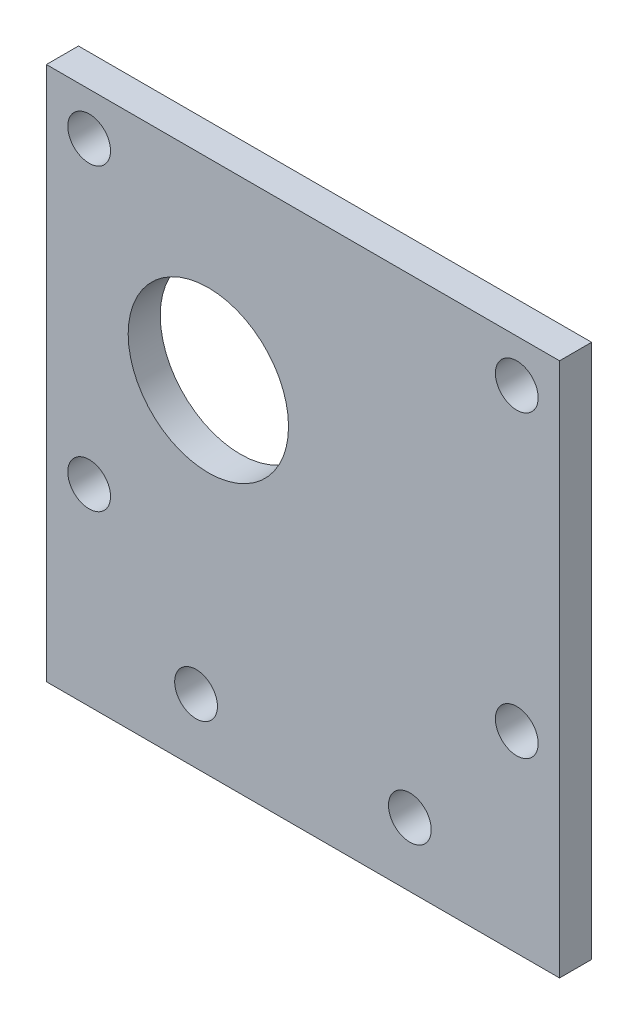
ISO-10303-21;
HEADER;
FILE_DESCRIPTION(('STEP AP214'),'2;1');
FILE_NAME('part.step','',(''),(''),'','','');
FILE_SCHEMA(('AUTOMOTIVE_DESIGN { 1 0 10303 214 1 1 1 1 }'));
ENDSEC;
DATA;
#1=APPLICATION_CONTEXT('core data for automotive mechanical design processes');
#2=APPLICATION_PROTOCOL_DEFINITION('international standard','automotive_design',2000,#1);
#3=PRODUCT_CONTEXT('',#1,'mechanical');
#4=PRODUCT('Part','Part','',(#3));
#5=PRODUCT_RELATED_PRODUCT_CATEGORY('part','',(#4));
#6=PRODUCT_DEFINITION_FORMATION('','',#4);
#7=PRODUCT_DEFINITION_CONTEXT('part definition',#1,'design');
#8=PRODUCT_DEFINITION('design','',#6,#7);
#9=PRODUCT_DEFINITION_SHAPE('','',#8);
#10=(LENGTH_UNIT() NAMED_UNIT(*) SI_UNIT(.MILLI.,.METRE.));
#11=(NAMED_UNIT(*) PLANE_ANGLE_UNIT() SI_UNIT($,.RADIAN.));
#12=(NAMED_UNIT(*) SI_UNIT($,.STERADIAN.) SOLID_ANGLE_UNIT());
#13=UNCERTAINTY_MEASURE_WITH_UNIT(LENGTH_MEASURE(1.E-05),#10,'distance_accuracy_value','');
#14=(GEOMETRIC_REPRESENTATION_CONTEXT(3) GLOBAL_UNCERTAINTY_ASSIGNED_CONTEXT((#13)) GLOBAL_UNIT_ASSIGNED_CONTEXT((#10,
#11,#12)) REPRESENTATION_CONTEXT('',''));
#15=CARTESIAN_POINT('',(0.,0.,0.));
#16=DIRECTION('',(0.,0.,1.));
#17=DIRECTION('',(1.,0.,0.));
#18=AXIS2_PLACEMENT_3D('',#15,#16,#17);
#19=CARTESIAN_POINT('',(0.,0.,3.));
#20=DIRECTION('',(0.,0.,-1.));
#21=DIRECTION('',(-1.,0.,0.));
#22=AXIS2_PLACEMENT_3D('',#19,#20,#21);
#23=PLANE('',#22);
#24=DIRECTION('',(0.,-1.,0.));
#25=VECTOR('',#24,1.);
#26=CARTESIAN_POINT('',(0.,0.,3.));
#27=LINE('',#26,#25);
#28=CARTESIAN_POINT('',(0.,50.,3.));
#29=VERTEX_POINT('',#28);
#30=CARTESIAN_POINT('',(0.,0.,3.));
#31=VERTEX_POINT('',#30);
#32=EDGE_CURVE('E85',#29,#31,#27,.T.);
#33=ORIENTED_EDGE('',*,*,#32,.T.);
#34=DIRECTION('',(1.,0.,0.));
#35=VECTOR('',#34,1.);
#36=CARTESIAN_POINT('',(0.,0.,3.));
#37=LINE('',#36,#35);
#38=CARTESIAN_POINT('',(48.,0.,3.));
#39=VERTEX_POINT('',#38);
#40=EDGE_CURVE('E80',#31,#39,#37,.T.);
#41=ORIENTED_EDGE('',*,*,#40,.T.);
#42=DIRECTION('',(0.,1.,0.));
#43=VECTOR('',#42,1.);
#44=CARTESIAN_POINT('',(48.,0.,3.));
#45=LINE('',#44,#43);
#46=CARTESIAN_POINT('',(48.,50.,3.));
#47=VERTEX_POINT('',#46);
#48=EDGE_CURVE('E83',#39,#47,#45,.T.);
#49=ORIENTED_EDGE('',*,*,#48,.T.);
#50=DIRECTION('',(-1.,0.,0.));
#51=VECTOR('',#50,1.);
#52=CARTESIAN_POINT('',(0.,50.,3.));
#53=LINE('',#52,#51);
#54=EDGE_CURVE('E50',#47,#29,#53,.T.);
#55=ORIENTED_EDGE('',*,*,#54,.T.);
#56=EDGE_LOOP('',(#33,#41,#49,#55));
#57=FACE_BOUND('',#56,.T.);
#58=CARTESIAN_POINT('',(4.,46.,3.));
#59=DIRECTION('',(0.,0.,1.));
#60=DIRECTION('',(1.,0.,0.));
#61=AXIS2_PLACEMENT_3D('',#58,#59,#60);
#62=CIRCLE('',#61,2.);
#63=CARTESIAN_POINT('',(6.,46.,3.));
#64=VERTEX_POINT('',#63);
#65=EDGE_CURVE('E100',#64,#64,#62,.T.);
#66=ORIENTED_EDGE('',*,*,#65,.F.);
#67=EDGE_LOOP('',(#66));
#68=FACE_BOUND('',#67,.T.);
#69=CARTESIAN_POINT('',(44.,46.,3.));
#70=DIRECTION('',(0.,0.,1.));
#71=DIRECTION('',(1.,0.,0.));
#72=AXIS2_PLACEMENT_3D('',#69,#70,#71);
#73=CIRCLE('',#72,2.);
#74=CARTESIAN_POINT('',(46.,46.,3.));
#75=VERTEX_POINT('',#74);
#76=EDGE_CURVE('E115',#75,#75,#73,.T.);
#77=ORIENTED_EDGE('',*,*,#76,.F.);
#78=EDGE_LOOP('',(#77));
#79=FACE_BOUND('',#78,.T.);
#80=CARTESIAN_POINT('',(44.,18.,3.));
#81=DIRECTION('',(0.,0.,1.));
#82=DIRECTION('',(1.,0.,0.));
#83=AXIS2_PLACEMENT_3D('',#80,#81,#82);
#84=CIRCLE('',#83,2.);
#85=CARTESIAN_POINT('',(46.,18.,3.));
#86=VERTEX_POINT('',#85);
#87=EDGE_CURVE('E121',#86,#86,#84,.T.);
#88=ORIENTED_EDGE('',*,*,#87,.F.);
#89=EDGE_LOOP('',(#88));
#90=FACE_BOUND('',#89,.T.);
#91=CARTESIAN_POINT('',(4.,18.,3.));
#92=DIRECTION('',(0.,0.,1.));
#93=DIRECTION('',(1.,0.,0.));
#94=AXIS2_PLACEMENT_3D('',#91,#92,#93);
#95=CIRCLE('',#94,2.);
#96=CARTESIAN_POINT('',(6.,18.,3.));
#97=VERTEX_POINT('',#96);
#98=EDGE_CURVE('E127',#97,#97,#95,.T.);
#99=ORIENTED_EDGE('',*,*,#98,.F.);
#100=EDGE_LOOP('',(#99));
#101=FACE_BOUND('',#100,.T.);
#102=CARTESIAN_POINT('',(34.,6.,3.));
#103=DIRECTION('',(0.,0.,1.));
#104=DIRECTION('',(1.,0.,0.));
#105=AXIS2_PLACEMENT_3D('',#102,#103,#104);
#106=CIRCLE('',#105,2.);
#107=CARTESIAN_POINT('',(36.,6.,3.));
#108=VERTEX_POINT('',#107);
#109=EDGE_CURVE('E133',#108,#108,#106,.T.);
#110=ORIENTED_EDGE('',*,*,#109,.F.);
#111=EDGE_LOOP('',(#110));
#112=FACE_BOUND('',#111,.T.);
#113=CARTESIAN_POINT('',(15.15,32.,3.));
#114=DIRECTION('',(0.,0.,1.));
#115=DIRECTION('',(1.,0.,0.));
#116=AXIS2_PLACEMENT_3D('',#113,#114,#115);
#117=CIRCLE('',#116,7.5);
#118=CARTESIAN_POINT('',(22.65,32.,3.));
#119=VERTEX_POINT('',#118);
#120=EDGE_CURVE('E139',#119,#119,#117,.T.);
#121=ORIENTED_EDGE('',*,*,#120,.F.);
#122=EDGE_LOOP('',(#121));
#123=FACE_BOUND('',#122,.T.);
#124=CARTESIAN_POINT('',(14.,6.,3.));
#125=DIRECTION('',(0.,0.,1.));
#126=DIRECTION('',(1.,0.,0.));
#127=AXIS2_PLACEMENT_3D('',#124,#125,#126);
#128=CIRCLE('',#127,2.);
#129=CARTESIAN_POINT('',(16.,6.,3.));
#130=VERTEX_POINT('',#129);
#131=EDGE_CURVE('E145',#130,#130,#128,.T.);
#132=ORIENTED_EDGE('',*,*,#131,.F.);
#133=EDGE_LOOP('',(#132));
#134=FACE_BOUND('',#133,.T.);
#135=ADVANCED_FACE('F33',(#57,#68,#79,#90,#101,#112,#123,#134),#23,.F.);
#136=CARTESIAN_POINT('',(0.,0.,0.));
#137=DIRECTION('',(0.,0.,-1.));
#138=DIRECTION('',(-1.,0.,0.));
#139=AXIS2_PLACEMENT_3D('',#136,#137,#138);
#140=PLANE('',#139);
#141=CARTESIAN_POINT('',(15.15,32.,0.));
#142=DIRECTION('',(0.,0.,1.));
#143=DIRECTION('',(1.,0.,0.));
#144=AXIS2_PLACEMENT_3D('',#141,#142,#143);
#145=CIRCLE('',#144,7.5);
#146=CARTESIAN_POINT('',(22.65,32.,0.));
#147=VERTEX_POINT('',#146);
#148=EDGE_CURVE('E142',#147,#147,#145,.T.);
#149=ORIENTED_EDGE('',*,*,#148,.T.);
#150=EDGE_LOOP('',(#149));
#151=FACE_BOUND('',#150,.T.);
#152=CARTESIAN_POINT('',(4.,18.,0.));
#153=DIRECTION('',(0.,0.,1.));
#154=DIRECTION('',(1.,0.,0.));
#155=AXIS2_PLACEMENT_3D('',#152,#153,#154);
#156=CIRCLE('',#155,2.);
#157=CARTESIAN_POINT('',(6.,18.,0.));
#158=VERTEX_POINT('',#157);
#159=EDGE_CURVE('E130',#158,#158,#156,.T.);
#160=ORIENTED_EDGE('',*,*,#159,.T.);
#161=EDGE_LOOP('',(#160));
#162=FACE_BOUND('',#161,.T.);
#163=CARTESIAN_POINT('',(44.,46.,0.));
#164=DIRECTION('',(0.,0.,1.));
#165=DIRECTION('',(1.,0.,0.));
#166=AXIS2_PLACEMENT_3D('',#163,#164,#165);
#167=CIRCLE('',#166,2.);
#168=CARTESIAN_POINT('',(46.,46.,0.));
#169=VERTEX_POINT('',#168);
#170=EDGE_CURVE('E118',#169,#169,#167,.T.);
#171=ORIENTED_EDGE('',*,*,#170,.T.);
#172=EDGE_LOOP('',(#171));
#173=FACE_BOUND('',#172,.T.);
#174=DIRECTION('',(0.,-1.,0.));
#175=VECTOR('',#174,1.);
#176=CARTESIAN_POINT('',(0.,0.,0.));
#177=LINE('',#176,#175);
#178=CARTESIAN_POINT('',(0.,50.,0.));
#179=VERTEX_POINT('',#178);
#180=CARTESIAN_POINT('',(0.,0.,0.));
#181=VERTEX_POINT('',#180);
#182=EDGE_CURVE('E97',#179,#181,#177,.T.);
#183=ORIENTED_EDGE('',*,*,#182,.F.);
#184=DIRECTION('',(-1.,0.,0.));
#185=VECTOR('',#184,1.);
#186=CARTESIAN_POINT('',(0.,50.,0.));
#187=LINE('',#186,#185);
#188=CARTESIAN_POINT('',(48.,50.,0.));
#189=VERTEX_POINT('',#188);
#190=EDGE_CURVE('E73',#189,#179,#187,.T.);
#191=ORIENTED_EDGE('',*,*,#190,.F.);
#192=DIRECTION('',(0.,1.,0.));
#193=VECTOR('',#192,1.);
#194=CARTESIAN_POINT('',(48.,0.,0.));
#195=LINE('',#194,#193);
#196=CARTESIAN_POINT('',(48.,0.,0.));
#197=VERTEX_POINT('',#196);
#198=EDGE_CURVE('E67',#197,#189,#195,.T.);
#199=ORIENTED_EDGE('',*,*,#198,.F.);
#200=DIRECTION('',(1.,0.,0.));
#201=VECTOR('',#200,1.);
#202=CARTESIAN_POINT('',(0.,0.,0.));
#203=LINE('',#202,#201);
#204=EDGE_CURVE('E89',#181,#197,#203,.T.);
#205=ORIENTED_EDGE('',*,*,#204,.F.);
#206=EDGE_LOOP('',(#183,#191,#199,#205));
#207=FACE_BOUND('',#206,.T.);
#208=CARTESIAN_POINT('',(4.,46.,0.));
#209=DIRECTION('',(0.,0.,1.));
#210=DIRECTION('',(1.,0.,0.));
#211=AXIS2_PLACEMENT_3D('',#208,#209,#210);
#212=CIRCLE('',#211,2.);
#213=CARTESIAN_POINT('',(6.,46.,0.));
#214=VERTEX_POINT('',#213);
#215=EDGE_CURVE('E112',#214,#214,#212,.T.);
#216=ORIENTED_EDGE('',*,*,#215,.T.);
#217=EDGE_LOOP('',(#216));
#218=FACE_BOUND('',#217,.T.);
#219=CARTESIAN_POINT('',(44.,18.,0.));
#220=DIRECTION('',(0.,0.,1.));
#221=DIRECTION('',(1.,0.,0.));
#222=AXIS2_PLACEMENT_3D('',#219,#220,#221);
#223=CIRCLE('',#222,2.);
#224=CARTESIAN_POINT('',(46.,18.,0.));
#225=VERTEX_POINT('',#224);
#226=EDGE_CURVE('E124',#225,#225,#223,.T.);
#227=ORIENTED_EDGE('',*,*,#226,.T.);
#228=EDGE_LOOP('',(#227));
#229=FACE_BOUND('',#228,.T.);
#230=CARTESIAN_POINT('',(34.,6.,0.));
#231=DIRECTION('',(0.,0.,1.));
#232=DIRECTION('',(1.,0.,0.));
#233=AXIS2_PLACEMENT_3D('',#230,#231,#232);
#234=CIRCLE('',#233,2.);
#235=CARTESIAN_POINT('',(36.,6.,0.));
#236=VERTEX_POINT('',#235);
#237=EDGE_CURVE('E136',#236,#236,#234,.T.);
#238=ORIENTED_EDGE('',*,*,#237,.T.);
#239=EDGE_LOOP('',(#238));
#240=FACE_BOUND('',#239,.T.);
#241=CARTESIAN_POINT('',(14.,6.,0.));
#242=DIRECTION('',(0.,0.,1.));
#243=DIRECTION('',(1.,0.,0.));
#244=AXIS2_PLACEMENT_3D('',#241,#242,#243);
#245=CIRCLE('',#244,2.);
#246=CARTESIAN_POINT('',(16.,6.,0.));
#247=VERTEX_POINT('',#246);
#248=EDGE_CURVE('E148',#247,#247,#245,.T.);
#249=ORIENTED_EDGE('',*,*,#248,.T.);
#250=EDGE_LOOP('',(#249));
#251=FACE_BOUND('',#250,.T.);
#252=ADVANCED_FACE('F108',(#151,#162,#173,#207,#218,#229,#240,#251),#140,.T.);
#253=CARTESIAN_POINT('',(0.,0.,3.));
#254=DIRECTION('',(1.,0.,0.));
#255=DIRECTION('',(0.,0.,-1.));
#256=AXIS2_PLACEMENT_3D('',#253,#254,#255);
#257=PLANE('',#256);
#258=ORIENTED_EDGE('',*,*,#182,.T.);
#259=DIRECTION('',(0.,0.,-1.));
#260=VECTOR('',#259,1.);
#261=CARTESIAN_POINT('',(0.,0.,3.));
#262=LINE('',#261,#260);
#263=EDGE_CURVE('E11',#31,#181,#262,.T.);
#264=ORIENTED_EDGE('',*,*,#263,.F.);
#265=ORIENTED_EDGE('',*,*,#32,.F.);
#266=DIRECTION('',(0.,0.,-1.));
#267=VECTOR('',#266,1.);
#268=CARTESIAN_POINT('',(0.,50.,3.));
#269=LINE('',#268,#267);
#270=EDGE_CURVE('E93',#29,#179,#269,.T.);
#271=ORIENTED_EDGE('',*,*,#270,.T.);
#272=EDGE_LOOP('',(#258,#264,#265,#271));
#273=FACE_BOUND('',#272,.T.);
#274=ADVANCED_FACE('F35',(#273),#257,.F.);
#275=CARTESIAN_POINT('',(0.,0.,3.));
#276=DIRECTION('',(0.,1.,0.));
#277=DIRECTION('',(0.,0.,1.));
#278=AXIS2_PLACEMENT_3D('',#275,#276,#277);
#279=PLANE('',#278);
#280=ORIENTED_EDGE('',*,*,#204,.T.);
#281=DIRECTION('',(0.,0.,-1.));
#282=VECTOR('',#281,1.);
#283=CARTESIAN_POINT('',(48.,0.,3.));
#284=LINE('',#283,#282);
#285=EDGE_CURVE('E42',#39,#197,#284,.T.);
#286=ORIENTED_EDGE('',*,*,#285,.F.);
#287=ORIENTED_EDGE('',*,*,#40,.F.);
#288=ORIENTED_EDGE('',*,*,#263,.T.);
#289=EDGE_LOOP('',(#280,#286,#287,#288));
#290=FACE_BOUND('',#289,.T.);
#291=ADVANCED_FACE('F88',(#290),#279,.F.);
#292=CARTESIAN_POINT('',(48.,0.,3.));
#293=DIRECTION('',(-1.,0.,0.));
#294=DIRECTION('',(0.,0.,1.));
#295=AXIS2_PLACEMENT_3D('',#292,#293,#294);
#296=PLANE('',#295);
#297=ORIENTED_EDGE('',*,*,#198,.T.);
#298=DIRECTION('',(0.,0.,-1.));
#299=VECTOR('',#298,1.);
#300=CARTESIAN_POINT('',(48.,50.,3.));
#301=LINE('',#300,#299);
#302=EDGE_CURVE('E90',#47,#189,#301,.T.);
#303=ORIENTED_EDGE('',*,*,#302,.F.);
#304=ORIENTED_EDGE('',*,*,#48,.F.);
#305=ORIENTED_EDGE('',*,*,#285,.T.);
#306=EDGE_LOOP('',(#297,#303,#304,#305));
#307=FACE_BOUND('',#306,.T.);
#308=ADVANCED_FACE('F91',(#307),#296,.F.);
#309=CARTESIAN_POINT('',(0.,50.,3.));
#310=DIRECTION('',(0.,-1.,0.));
#311=DIRECTION('',(0.,0.,-1.));
#312=AXIS2_PLACEMENT_3D('',#309,#310,#311);
#313=PLANE('',#312);
#314=ORIENTED_EDGE('',*,*,#190,.T.);
#315=ORIENTED_EDGE('',*,*,#270,.F.);
#316=ORIENTED_EDGE('',*,*,#54,.F.);
#317=ORIENTED_EDGE('',*,*,#302,.T.);
#318=EDGE_LOOP('',(#314,#315,#316,#317));
#319=FACE_BOUND('',#318,.T.);
#320=ADVANCED_FACE('F105',(#319),#313,.F.);
#321=CARTESIAN_POINT('',(4.,46.,3.));
#322=DIRECTION('',(0.,0.,-1.));
#323=DIRECTION('',(-1.,0.,0.));
#324=AXIS2_PLACEMENT_3D('',#321,#322,#323);
#325=CYLINDRICAL_SURFACE('',#324,2.);
#326=ORIENTED_EDGE('',*,*,#65,.T.);
#327=EDGE_LOOP('',(#326));
#328=FACE_BOUND('',#327,.T.);
#329=ORIENTED_EDGE('',*,*,#215,.F.);
#330=EDGE_LOOP('',(#329));
#331=FACE_BOUND('',#330,.T.);
#332=ADVANCED_FACE('F165',(#328,#331),#325,.F.);
#333=CARTESIAN_POINT('',(44.,46.,3.));
#334=DIRECTION('',(0.,0.,-1.));
#335=DIRECTION('',(-1.,0.,0.));
#336=AXIS2_PLACEMENT_3D('',#333,#334,#335);
#337=CYLINDRICAL_SURFACE('',#336,2.);
#338=ORIENTED_EDGE('',*,*,#76,.T.);
#339=EDGE_LOOP('',(#338));
#340=FACE_BOUND('',#339,.T.);
#341=ORIENTED_EDGE('',*,*,#170,.F.);
#342=EDGE_LOOP('',(#341));
#343=FACE_BOUND('',#342,.T.);
#344=ADVANCED_FACE('F211',(#340,#343),#337,.F.);
#345=CARTESIAN_POINT('',(44.,18.,3.));
#346=DIRECTION('',(0.,0.,-1.));
#347=DIRECTION('',(-1.,0.,0.));
#348=AXIS2_PLACEMENT_3D('',#345,#346,#347);
#349=CYLINDRICAL_SURFACE('',#348,2.);
#350=ORIENTED_EDGE('',*,*,#87,.T.);
#351=EDGE_LOOP('',(#350));
#352=FACE_BOUND('',#351,.T.);
#353=ORIENTED_EDGE('',*,*,#226,.F.);
#354=EDGE_LOOP('',(#353));
#355=FACE_BOUND('',#354,.T.);
#356=ADVANCED_FACE('F219',(#352,#355),#349,.F.);
#357=CARTESIAN_POINT('',(4.,18.,3.));
#358=DIRECTION('',(0.,0.,-1.));
#359=DIRECTION('',(-1.,0.,0.));
#360=AXIS2_PLACEMENT_3D('',#357,#358,#359);
#361=CYLINDRICAL_SURFACE('',#360,2.);
#362=ORIENTED_EDGE('',*,*,#98,.T.);
#363=EDGE_LOOP('',(#362));
#364=FACE_BOUND('',#363,.T.);
#365=ORIENTED_EDGE('',*,*,#159,.F.);
#366=EDGE_LOOP('',(#365));
#367=FACE_BOUND('',#366,.T.);
#368=ADVANCED_FACE('F227',(#364,#367),#361,.F.);
#369=CARTESIAN_POINT('',(34.,6.,3.));
#370=DIRECTION('',(0.,0.,-1.));
#371=DIRECTION('',(-1.,0.,0.));
#372=AXIS2_PLACEMENT_3D('',#369,#370,#371);
#373=CYLINDRICAL_SURFACE('',#372,2.);
#374=ORIENTED_EDGE('',*,*,#109,.T.);
#375=EDGE_LOOP('',(#374));
#376=FACE_BOUND('',#375,.T.);
#377=ORIENTED_EDGE('',*,*,#237,.F.);
#378=EDGE_LOOP('',(#377));
#379=FACE_BOUND('',#378,.T.);
#380=ADVANCED_FACE('F236',(#376,#379),#373,.F.);
#381=CARTESIAN_POINT('',(15.15,32.,3.));
#382=DIRECTION('',(0.,0.,-1.));
#383=DIRECTION('',(-1.,0.,0.));
#384=AXIS2_PLACEMENT_3D('',#381,#382,#383);
#385=CYLINDRICAL_SURFACE('',#384,7.5);
#386=ORIENTED_EDGE('',*,*,#120,.T.);
#387=EDGE_LOOP('',(#386));
#388=FACE_BOUND('',#387,.T.);
#389=ORIENTED_EDGE('',*,*,#148,.F.);
#390=EDGE_LOOP('',(#389));
#391=FACE_BOUND('',#390,.T.);
#392=ADVANCED_FACE('F245',(#388,#391),#385,.F.);
#393=CARTESIAN_POINT('',(14.,6.,3.));
#394=DIRECTION('',(0.,0.,-1.));
#395=DIRECTION('',(-1.,0.,0.));
#396=AXIS2_PLACEMENT_3D('',#393,#394,#395);
#397=CYLINDRICAL_SURFACE('',#396,2.);
#398=ORIENTED_EDGE('',*,*,#131,.T.);
#399=EDGE_LOOP('',(#398));
#400=FACE_BOUND('',#399,.T.);
#401=ORIENTED_EDGE('',*,*,#248,.F.);
#402=EDGE_LOOP('',(#401));
#403=FACE_BOUND('',#402,.T.);
#404=ADVANCED_FACE('F154',(#400,#403),#397,.F.);
#405=CLOSED_SHELL('',(#135,#252,#274,#291,#308,#320,#332,#344,#356,#368,#380,#392,#404));
#406=MANIFOLD_SOLID_BREP('B2',#405);
#407=ADVANCED_BREP_SHAPE_REPRESENTATION('',(#18,#406),#14);
#408=SHAPE_DEFINITION_REPRESENTATION(#9,#407);
ENDSEC;
END-ISO-10303-21;
